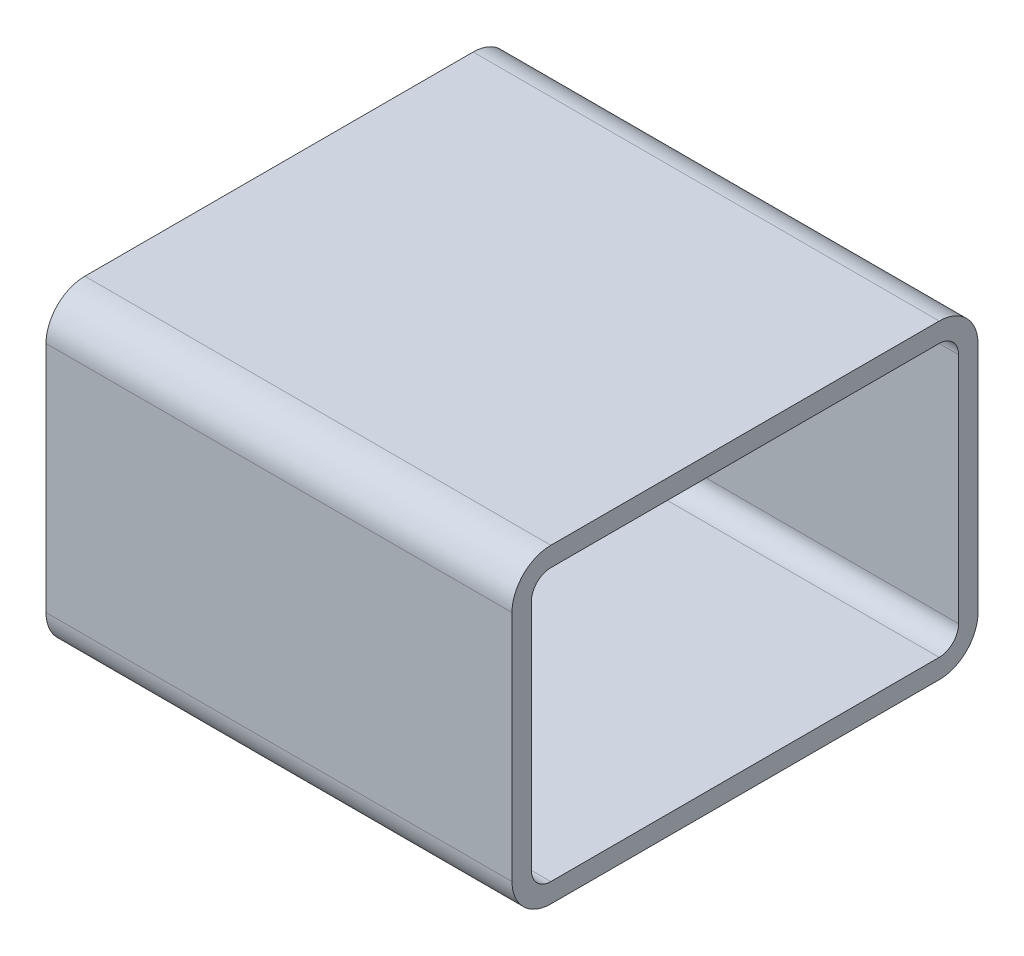
ISO-10303-21;
HEADER;
FILE_DESCRIPTION(('STEP AP214'),'2;1');
FILE_NAME('part.step','',(''),(''),'','','');
FILE_SCHEMA(('AUTOMOTIVE_DESIGN { 1 0 10303 214 1 1 1 1 }'));
ENDSEC;
DATA;
#1=APPLICATION_CONTEXT('core data for automotive mechanical design processes');
#2=APPLICATION_PROTOCOL_DEFINITION('international standard','automotive_design',2000,#1);
#3=PRODUCT_CONTEXT('',#1,'mechanical');
#4=PRODUCT('Part','Part','',(#3));
#5=PRODUCT_RELATED_PRODUCT_CATEGORY('part','',(#4));
#6=PRODUCT_DEFINITION_FORMATION('','',#4);
#7=PRODUCT_DEFINITION_CONTEXT('part definition',#1,'design');
#8=PRODUCT_DEFINITION('design','',#6,#7);
#9=PRODUCT_DEFINITION_SHAPE('','',#8);
#10=(LENGTH_UNIT() NAMED_UNIT(*) SI_UNIT(.MILLI.,.METRE.));
#11=(NAMED_UNIT(*) PLANE_ANGLE_UNIT() SI_UNIT($,.RADIAN.));
#12=(NAMED_UNIT(*) SI_UNIT($,.STERADIAN.) SOLID_ANGLE_UNIT());
#13=UNCERTAINTY_MEASURE_WITH_UNIT(LENGTH_MEASURE(1.E-05),#10,'distance_accuracy_value','');
#14=(GEOMETRIC_REPRESENTATION_CONTEXT(3) GLOBAL_UNCERTAINTY_ASSIGNED_CONTEXT((#13)) GLOBAL_UNIT_ASSIGNED_CONTEXT((#10,
#11,#12)) REPRESENTATION_CONTEXT('',''));
#15=CARTESIAN_POINT('',(0.,0.,0.));
#16=DIRECTION('',(0.,0.,1.));
#17=DIRECTION('',(1.,0.,0.));
#18=AXIS2_PLACEMENT_3D('',#15,#16,#17);
#19=CARTESIAN_POINT('',(0.,6.35,-38.1));
#20=DIRECTION('',(0.,0.,-1.));
#21=DIRECTION('',(-1.,0.,0.));
#22=AXIS2_PLACEMENT_3D('',#19,#20,#21);
#23=PLANE('',#22);
#24=DIRECTION('',(1.,0.,0.));
#25=VECTOR('',#24,1.);
#26=CARTESIAN_POINT('',(0.,6.35,-38.1));
#27=LINE('',#26,#25);
#28=CARTESIAN_POINT('',(0.,6.35,-38.1));
#29=VERTEX_POINT('',#28);
#30=CARTESIAN_POINT('',(76.2,6.35,-38.1));
#31=VERTEX_POINT('',#30);
#32=EDGE_CURVE('E111',#29,#31,#27,.T.);
#33=ORIENTED_EDGE('',*,*,#32,.F.);
#34=DIRECTION('',(0.,1.,0.));
#35=VECTOR('',#34,1.);
#36=CARTESIAN_POINT('',(0.,0.,-38.1));
#37=LINE('',#36,#35);
#38=CARTESIAN_POINT('',(0.,44.45,-38.1));
#39=VERTEX_POINT('',#38);
#40=EDGE_CURVE('E213',#29,#39,#37,.T.);
#41=ORIENTED_EDGE('',*,*,#40,.T.);
#42=DIRECTION('',(1.,0.,0.));
#43=VECTOR('',#42,1.);
#44=CARTESIAN_POINT('',(0.,44.45,-38.1));
#45=LINE('',#44,#43);
#46=CARTESIAN_POINT('',(76.2,44.45,-38.1));
#47=VERTEX_POINT('',#46);
#48=EDGE_CURVE('E188',#47,#39,#45,.F.);
#49=ORIENTED_EDGE('',*,*,#48,.F.);
#50=DIRECTION('',(0.,1.,0.));
#51=VECTOR('',#50,1.);
#52=CARTESIAN_POINT('',(76.2,0.,-38.1));
#53=LINE('',#52,#51);
#54=EDGE_CURVE('E115',#31,#47,#53,.T.);
#55=ORIENTED_EDGE('',*,*,#54,.F.);
#56=EDGE_LOOP('',(#33,#41,#49,#55));
#57=FACE_BOUND('',#56,.T.);
#58=ADVANCED_FACE('F17',(#57),#23,.T.);
#59=CARTESIAN_POINT('',(0.,44.45,-31.75));
#60=DIRECTION('',(1.,0.,0.));
#61=DIRECTION('',(0.,0.,-1.));
#62=AXIS2_PLACEMENT_3D('',#59,#60,#61);
#63=CYLINDRICAL_SURFACE('',#62,6.35);
#64=ORIENTED_EDGE('',*,*,#48,.T.);
#65=CARTESIAN_POINT('',(0.,44.45,-31.75));
#66=DIRECTION('',(1.,0.,0.));
#67=DIRECTION('',(0.,0.,-1.));
#68=AXIS2_PLACEMENT_3D('',#65,#66,#67);
#69=CIRCLE('',#68,6.35);
#70=CARTESIAN_POINT('',(0.,50.8,-31.75));
#71=VERTEX_POINT('',#70);
#72=EDGE_CURVE('E211',#39,#71,#69,.T.);
#73=ORIENTED_EDGE('',*,*,#72,.T.);
#74=DIRECTION('',(1.,0.,0.));
#75=VECTOR('',#74,1.);
#76=CARTESIAN_POINT('',(0.,50.8,-31.75));
#77=LINE('',#76,#75);
#78=CARTESIAN_POINT('',(76.2,50.8,-31.75));
#79=VERTEX_POINT('',#78);
#80=EDGE_CURVE('E185',#79,#71,#77,.F.);
#81=ORIENTED_EDGE('',*,*,#80,.F.);
#82=CARTESIAN_POINT('',(76.2,44.45,-31.75));
#83=DIRECTION('',(1.,0.,0.));
#84=DIRECTION('',(0.,0.,-1.));
#85=AXIS2_PLACEMENT_3D('',#82,#83,#84);
#86=CIRCLE('',#85,6.35);
#87=EDGE_CURVE('E154',#47,#79,#86,.T.);
#88=ORIENTED_EDGE('',*,*,#87,.F.);
#89=EDGE_LOOP('',(#64,#73,#81,#88));
#90=FACE_BOUND('',#89,.T.);
#91=ADVANCED_FACE('F229',(#90),#63,.T.);
#92=CARTESIAN_POINT('',(0.,50.8,-31.75));
#93=DIRECTION('',(0.,1.,0.));
#94=DIRECTION('',(0.,0.,1.));
#95=AXIS2_PLACEMENT_3D('',#92,#93,#94);
#96=PLANE('',#95);
#97=ORIENTED_EDGE('',*,*,#80,.T.);
#98=DIRECTION('',(0.,0.,-1.));
#99=VECTOR('',#98,1.);
#100=CARTESIAN_POINT('',(0.,50.8,0.));
#101=LINE('',#100,#99);
#102=CARTESIAN_POINT('',(0.,50.8,31.75));
#103=VERTEX_POINT('',#102);
#104=EDGE_CURVE('E210',#71,#103,#101,.F.);
#105=ORIENTED_EDGE('',*,*,#104,.T.);
#106=DIRECTION('',(1.,0.,0.));
#107=VECTOR('',#106,1.);
#108=CARTESIAN_POINT('',(0.,50.8,31.75));
#109=LINE('',#108,#107);
#110=CARTESIAN_POINT('',(76.2,50.8,31.75));
#111=VERTEX_POINT('',#110);
#112=EDGE_CURVE('E182',#111,#103,#109,.F.);
#113=ORIENTED_EDGE('',*,*,#112,.F.);
#114=DIRECTION('',(0.,0.,-1.));
#115=VECTOR('',#114,1.);
#116=CARTESIAN_POINT('',(76.2,50.8,0.));
#117=LINE('',#116,#115);
#118=EDGE_CURVE('E151',#79,#111,#117,.F.);
#119=ORIENTED_EDGE('',*,*,#118,.F.);
#120=EDGE_LOOP('',(#97,#105,#113,#119));
#121=FACE_BOUND('',#120,.T.);
#122=ADVANCED_FACE('F233',(#121),#96,.T.);
#123=CARTESIAN_POINT('',(0.,44.45,31.75));
#124=DIRECTION('',(1.,0.,0.));
#125=DIRECTION('',(0.,0.,-1.));
#126=AXIS2_PLACEMENT_3D('',#123,#124,#125);
#127=CYLINDRICAL_SURFACE('',#126,6.35);
#128=ORIENTED_EDGE('',*,*,#112,.T.);
#129=CARTESIAN_POINT('',(0.,44.45,31.75));
#130=DIRECTION('',(1.,0.,0.));
#131=DIRECTION('',(0.,0.,-1.));
#132=AXIS2_PLACEMENT_3D('',#129,#130,#131);
#133=CIRCLE('',#132,6.35);
#134=CARTESIAN_POINT('',(0.,44.45,38.1));
#135=VERTEX_POINT('',#134);
#136=EDGE_CURVE('E208',#103,#135,#133,.T.);
#137=ORIENTED_EDGE('',*,*,#136,.T.);
#138=DIRECTION('',(1.,0.,0.));
#139=VECTOR('',#138,1.);
#140=CARTESIAN_POINT('',(0.,44.45,38.1));
#141=LINE('',#140,#139);
#142=CARTESIAN_POINT('',(76.2,44.45,38.1));
#143=VERTEX_POINT('',#142);
#144=EDGE_CURVE('E176',#143,#135,#141,.F.);
#145=ORIENTED_EDGE('',*,*,#144,.F.);
#146=CARTESIAN_POINT('',(76.2,44.45,31.75));
#147=DIRECTION('',(1.,0.,0.));
#148=DIRECTION('',(0.,0.,-1.));
#149=AXIS2_PLACEMENT_3D('',#146,#147,#148);
#150=CIRCLE('',#149,6.35);
#151=EDGE_CURVE('E150',#111,#143,#150,.T.);
#152=ORIENTED_EDGE('',*,*,#151,.F.);
#153=EDGE_LOOP('',(#128,#137,#145,#152));
#154=FACE_BOUND('',#153,.T.);
#155=ADVANCED_FACE('F237',(#154),#127,.T.);
#156=CARTESIAN_POINT('',(0.,44.45,38.1));
#157=DIRECTION('',(0.,0.,1.));
#158=DIRECTION('',(1.,0.,0.));
#159=AXIS2_PLACEMENT_3D('',#156,#157,#158);
#160=PLANE('',#159);
#161=ORIENTED_EDGE('',*,*,#144,.T.);
#162=DIRECTION('',(0.,1.,0.));
#163=VECTOR('',#162,1.);
#164=CARTESIAN_POINT('',(0.,0.,38.1));
#165=LINE('',#164,#163);
#166=CARTESIAN_POINT('',(0.,6.35,38.1));
#167=VERTEX_POINT('',#166);
#168=EDGE_CURVE('E207',#135,#167,#165,.F.);
#169=ORIENTED_EDGE('',*,*,#168,.T.);
#170=DIRECTION('',(1.,0.,0.));
#171=VECTOR('',#170,1.);
#172=CARTESIAN_POINT('',(0.,6.35,38.1));
#173=LINE('',#172,#171);
#174=CARTESIAN_POINT('',(76.2,6.35,38.1));
#175=VERTEX_POINT('',#174);
#176=EDGE_CURVE('E177',#175,#167,#173,.F.);
#177=ORIENTED_EDGE('',*,*,#176,.F.);
#178=DIRECTION('',(0.,1.,0.));
#179=VECTOR('',#178,1.);
#180=CARTESIAN_POINT('',(76.2,0.,38.1));
#181=LINE('',#180,#179);
#182=EDGE_CURVE('E148',#143,#175,#181,.F.);
#183=ORIENTED_EDGE('',*,*,#182,.F.);
#184=EDGE_LOOP('',(#161,#169,#177,#183));
#185=FACE_BOUND('',#184,.T.);
#186=ADVANCED_FACE('F242',(#185),#160,.T.);
#187=CARTESIAN_POINT('',(0.,44.45,-31.75));
#188=DIRECTION('',(1.,0.,0.));
#189=DIRECTION('',(0.,0.,-1.));
#190=AXIS2_PLACEMENT_3D('',#187,#188,#189);
#191=CYLINDRICAL_SURFACE('',#190,3.175);
#192=CARTESIAN_POINT('',(76.2,44.45,-31.75));
#193=DIRECTION('',(1.,0.,0.));
#194=DIRECTION('',(0.,0.,-1.));
#195=AXIS2_PLACEMENT_3D('',#192,#193,#194);
#196=CIRCLE('',#195,3.175);
#197=CARTESIAN_POINT('',(76.2,47.625,-31.75));
#198=VERTEX_POINT('',#197);
#199=CARTESIAN_POINT('',(76.2,44.45,-34.925));
#200=VERTEX_POINT('',#199);
#201=EDGE_CURVE('E135',#198,#200,#196,.F.);
#202=ORIENTED_EDGE('',*,*,#201,.F.);
#203=DIRECTION('',(1.,0.,0.));
#204=VECTOR('',#203,1.);
#205=CARTESIAN_POINT('',(0.,47.625,-31.75));
#206=LINE('',#205,#204);
#207=CARTESIAN_POINT('',(0.,47.625,-31.75));
#208=VERTEX_POINT('',#207);
#209=EDGE_CURVE('E159',#208,#198,#206,.T.);
#210=ORIENTED_EDGE('',*,*,#209,.F.);
#211=CARTESIAN_POINT('',(0.,44.45,-31.75));
#212=DIRECTION('',(1.,0.,0.));
#213=DIRECTION('',(0.,0.,-1.));
#214=AXIS2_PLACEMENT_3D('',#211,#212,#213);
#215=CIRCLE('',#214,3.175);
#216=CARTESIAN_POINT('',(0.,44.45,-34.925));
#217=VERTEX_POINT('',#216);
#218=EDGE_CURVE('E203',#208,#217,#215,.F.);
#219=ORIENTED_EDGE('',*,*,#218,.T.);
#220=DIRECTION('',(1.,0.,0.));
#221=VECTOR('',#220,1.);
#222=CARTESIAN_POINT('',(0.,44.45,-34.925));
#223=LINE('',#222,#221);
#224=EDGE_CURVE('E173',#200,#217,#223,.F.);
#225=ORIENTED_EDGE('',*,*,#224,.F.);
#226=EDGE_LOOP('',(#202,#210,#219,#225));
#227=FACE_BOUND('',#226,.T.);
#228=ADVANCED_FACE('F307',(#227),#191,.F.);
#229=CARTESIAN_POINT('',(0.,44.45,-34.925));
#230=DIRECTION('',(0.,0.,1.));
#231=DIRECTION('',(1.,0.,0.));
#232=AXIS2_PLACEMENT_3D('',#229,#230,#231);
#233=PLANE('',#232);
#234=ORIENTED_EDGE('',*,*,#224,.T.);
#235=DIRECTION('',(0.,1.,0.));
#236=VECTOR('',#235,1.);
#237=CARTESIAN_POINT('',(0.,0.,-34.925));
#238=LINE('',#237,#236);
#239=CARTESIAN_POINT('',(0.,6.35,-34.925));
#240=VERTEX_POINT('',#239);
#241=EDGE_CURVE('E202',#217,#240,#238,.F.);
#242=ORIENTED_EDGE('',*,*,#241,.T.);
#243=DIRECTION('',(1.,0.,0.));
#244=VECTOR('',#243,1.);
#245=CARTESIAN_POINT('',(0.,6.35,-34.925));
#246=LINE('',#245,#244);
#247=CARTESIAN_POINT('',(76.2,6.35,-34.925));
#248=VERTEX_POINT('',#247);
#249=EDGE_CURVE('E171',#240,#248,#246,.T.);
#250=ORIENTED_EDGE('',*,*,#249,.T.);
#251=DIRECTION('',(0.,1.,0.));
#252=VECTOR('',#251,1.);
#253=CARTESIAN_POINT('',(76.2,0.,-34.925));
#254=LINE('',#253,#252);
#255=EDGE_CURVE('E145',#200,#248,#254,.F.);
#256=ORIENTED_EDGE('',*,*,#255,.F.);
#257=EDGE_LOOP('',(#234,#242,#250,#256));
#258=FACE_BOUND('',#257,.T.);
#259=ADVANCED_FACE('F306',(#258),#233,.T.);
#260=CARTESIAN_POINT('',(0.,6.35,-31.75));
#261=DIRECTION('',(1.,0.,0.));
#262=DIRECTION('',(0.,0.,-1.));
#263=AXIS2_PLACEMENT_3D('',#260,#261,#262);
#264=CYLINDRICAL_SURFACE('',#263,3.175);
#265=CARTESIAN_POINT('',(76.2,6.35,-31.75));
#266=DIRECTION('',(1.,0.,0.));
#267=DIRECTION('',(0.,0.,-1.));
#268=AXIS2_PLACEMENT_3D('',#265,#266,#267);
#269=CIRCLE('',#268,3.175);
#270=CARTESIAN_POINT('',(76.2,3.175,-31.75));
#271=VERTEX_POINT('',#270);
#272=EDGE_CURVE('E144',#248,#271,#269,.F.);
#273=ORIENTED_EDGE('',*,*,#272,.F.);
#274=ORIENTED_EDGE('',*,*,#249,.F.);
#275=CARTESIAN_POINT('',(0.,6.35,-31.75));
#276=DIRECTION('',(1.,0.,0.));
#277=DIRECTION('',(0.,0.,-1.));
#278=AXIS2_PLACEMENT_3D('',#275,#276,#277);
#279=CIRCLE('',#278,3.175);
#280=CARTESIAN_POINT('',(0.,3.175,-31.75));
#281=VERTEX_POINT('',#280);
#282=EDGE_CURVE('E199',#240,#281,#279,.F.);
#283=ORIENTED_EDGE('',*,*,#282,.T.);
#284=DIRECTION('',(1.,0.,0.));
#285=VECTOR('',#284,1.);
#286=CARTESIAN_POINT('',(0.,3.175,-31.75));
#287=LINE('',#286,#285);
#288=EDGE_CURVE('E168',#271,#281,#287,.F.);
#289=ORIENTED_EDGE('',*,*,#288,.F.);
#290=EDGE_LOOP('',(#273,#274,#283,#289));
#291=FACE_BOUND('',#290,.T.);
#292=ADVANCED_FACE('F304',(#291),#264,.F.);
#293=CARTESIAN_POINT('',(0.,3.175,-31.75));
#294=DIRECTION('',(0.,1.,0.));
#295=DIRECTION('',(0.,0.,1.));
#296=AXIS2_PLACEMENT_3D('',#293,#294,#295);
#297=PLANE('',#296);
#298=ORIENTED_EDGE('',*,*,#288,.T.);
#299=DIRECTION('',(0.,0.,-1.));
#300=VECTOR('',#299,1.);
#301=CARTESIAN_POINT('',(0.,3.175,0.));
#302=LINE('',#301,#300);
#303=CARTESIAN_POINT('',(0.,3.175,31.75));
#304=VERTEX_POINT('',#303);
#305=EDGE_CURVE('E198',#281,#304,#302,.F.);
#306=ORIENTED_EDGE('',*,*,#305,.T.);
#307=DIRECTION('',(1.,0.,0.));
#308=VECTOR('',#307,1.);
#309=CARTESIAN_POINT('',(0.,3.175,31.75));
#310=LINE('',#309,#308);
#311=CARTESIAN_POINT('',(76.2,3.175,31.75));
#312=VERTEX_POINT('',#311);
#313=EDGE_CURVE('E166',#304,#312,#310,.T.);
#314=ORIENTED_EDGE('',*,*,#313,.T.);
#315=DIRECTION('',(0.,0.,-1.));
#316=VECTOR('',#315,1.);
#317=CARTESIAN_POINT('',(76.2,3.175,0.));
#318=LINE('',#317,#316);
#319=EDGE_CURVE('E141',#271,#312,#318,.F.);
#320=ORIENTED_EDGE('',*,*,#319,.F.);
#321=EDGE_LOOP('',(#298,#306,#314,#320));
#322=FACE_BOUND('',#321,.T.);
#323=ADVANCED_FACE('F293',(#322),#297,.T.);
#324=CARTESIAN_POINT('',(0.,6.35,31.75));
#325=DIRECTION('',(1.,0.,0.));
#326=DIRECTION('',(0.,0.,-1.));
#327=AXIS2_PLACEMENT_3D('',#324,#325,#326);
#328=CYLINDRICAL_SURFACE('',#327,3.175);
#329=CARTESIAN_POINT('',(76.2,6.35,31.75));
#330=DIRECTION('',(1.,0.,0.));
#331=DIRECTION('',(0.,0.,-1.));
#332=AXIS2_PLACEMENT_3D('',#329,#330,#331);
#333=CIRCLE('',#332,3.175);
#334=CARTESIAN_POINT('',(76.2,6.35,34.925));
#335=VERTEX_POINT('',#334);
#336=EDGE_CURVE('E140',#312,#335,#333,.F.);
#337=ORIENTED_EDGE('',*,*,#336,.F.);
#338=ORIENTED_EDGE('',*,*,#313,.F.);
#339=CARTESIAN_POINT('',(0.,6.35,31.75));
#340=DIRECTION('',(1.,0.,0.));
#341=DIRECTION('',(0.,0.,-1.));
#342=AXIS2_PLACEMENT_3D('',#339,#340,#341);
#343=CIRCLE('',#342,3.175);
#344=CARTESIAN_POINT('',(0.,6.35,34.925));
#345=VERTEX_POINT('',#344);
#346=EDGE_CURVE('E195',#304,#345,#343,.F.);
#347=ORIENTED_EDGE('',*,*,#346,.T.);
#348=DIRECTION('',(-1.,0.,0.));
#349=VECTOR('',#348,1.);
#350=CARTESIAN_POINT('',(0.,6.35,34.925));
#351=LINE('',#350,#349);
#352=EDGE_CURVE('E163',#335,#345,#351,.T.);
#353=ORIENTED_EDGE('',*,*,#352,.F.);
#354=EDGE_LOOP('',(#337,#338,#347,#353));
#355=FACE_BOUND('',#354,.T.);
#356=ADVANCED_FACE('F298',(#355),#328,.F.);
#357=CARTESIAN_POINT('',(0.,6.35,34.925));
#358=DIRECTION('',(0.,0.,-1.));
#359=DIRECTION('',(-1.,0.,0.));
#360=AXIS2_PLACEMENT_3D('',#357,#358,#359);
#361=PLANE('',#360);
#362=ORIENTED_EDGE('',*,*,#352,.T.);
#363=DIRECTION('',(0.,1.,0.));
#364=VECTOR('',#363,1.);
#365=CARTESIAN_POINT('',(0.,0.,34.925));
#366=LINE('',#365,#364);
#367=CARTESIAN_POINT('',(0.,44.45,34.925));
#368=VERTEX_POINT('',#367);
#369=EDGE_CURVE('E194',#345,#368,#366,.T.);
#370=ORIENTED_EDGE('',*,*,#369,.T.);
#371=DIRECTION('',(1.,0.,0.));
#372=VECTOR('',#371,1.);
#373=CARTESIAN_POINT('',(0.,44.45,34.925));
#374=LINE('',#373,#372);
#375=CARTESIAN_POINT('',(76.2,44.45,34.925));
#376=VERTEX_POINT('',#375);
#377=EDGE_CURVE('E161',#368,#376,#374,.T.);
#378=ORIENTED_EDGE('',*,*,#377,.T.);
#379=DIRECTION('',(0.,1.,0.));
#380=VECTOR('',#379,1.);
#381=CARTESIAN_POINT('',(76.2,0.,34.925));
#382=LINE('',#381,#380);
#383=EDGE_CURVE('E137',#335,#376,#382,.T.);
#384=ORIENTED_EDGE('',*,*,#383,.F.);
#385=EDGE_LOOP('',(#362,#370,#378,#384));
#386=FACE_BOUND('',#385,.T.);
#387=ADVANCED_FACE('F258',(#386),#361,.T.);
#388=CARTESIAN_POINT('',(0.,44.45,31.75));
#389=DIRECTION('',(1.,0.,0.));
#390=DIRECTION('',(0.,0.,-1.));
#391=AXIS2_PLACEMENT_3D('',#388,#389,#390);
#392=CYLINDRICAL_SURFACE('',#391,3.175);
#393=CARTESIAN_POINT('',(76.2,44.45,31.75));
#394=DIRECTION('',(1.,0.,0.));
#395=DIRECTION('',(0.,0.,-1.));
#396=AXIS2_PLACEMENT_3D('',#393,#394,#395);
#397=CIRCLE('',#396,3.175);
#398=CARTESIAN_POINT('',(76.2,47.625,31.75));
#399=VERTEX_POINT('',#398);
#400=EDGE_CURVE('E136',#376,#399,#397,.F.);
#401=ORIENTED_EDGE('',*,*,#400,.F.);
#402=ORIENTED_EDGE('',*,*,#377,.F.);
#403=CARTESIAN_POINT('',(0.,44.45,31.75));
#404=DIRECTION('',(1.,0.,0.));
#405=DIRECTION('',(0.,0.,-1.));
#406=AXIS2_PLACEMENT_3D('',#403,#404,#405);
#407=CIRCLE('',#406,3.175);
#408=CARTESIAN_POINT('',(0.,47.625,31.75));
#409=VERTEX_POINT('',#408);
#410=EDGE_CURVE('E128',#368,#409,#407,.F.);
#411=ORIENTED_EDGE('',*,*,#410,.T.);
#412=DIRECTION('',(1.,0.,0.));
#413=VECTOR('',#412,1.);
#414=CARTESIAN_POINT('',(0.,47.625,31.75));
#415=LINE('',#414,#413);
#416=EDGE_CURVE('E156',#399,#409,#415,.F.);
#417=ORIENTED_EDGE('',*,*,#416,.F.);
#418=EDGE_LOOP('',(#401,#402,#411,#417));
#419=FACE_BOUND('',#418,.T.);
#420=ADVANCED_FACE('F267',(#419),#392,.F.);
#421=CARTESIAN_POINT('',(0.,47.625,31.75));
#422=DIRECTION('',(0.,-1.,0.));
#423=DIRECTION('',(0.,0.,-1.));
#424=AXIS2_PLACEMENT_3D('',#421,#422,#423);
#425=PLANE('',#424);
#426=ORIENTED_EDGE('',*,*,#416,.T.);
#427=DIRECTION('',(0.,0.,-1.));
#428=VECTOR('',#427,1.);
#429=CARTESIAN_POINT('',(0.,47.625,0.));
#430=LINE('',#429,#428);
#431=EDGE_CURVE('E125',#409,#208,#430,.T.);
#432=ORIENTED_EDGE('',*,*,#431,.T.);
#433=ORIENTED_EDGE('',*,*,#209,.T.);
#434=DIRECTION('',(0.,0.,-1.));
#435=VECTOR('',#434,1.);
#436=CARTESIAN_POINT('',(76.2,47.625,0.));
#437=LINE('',#436,#435);
#438=EDGE_CURVE('E132',#399,#198,#437,.T.);
#439=ORIENTED_EDGE('',*,*,#438,.F.);
#440=EDGE_LOOP('',(#426,#432,#433,#439));
#441=FACE_BOUND('',#440,.T.);
#442=ADVANCED_FACE('F276',(#441),#425,.T.);
#443=CARTESIAN_POINT('',(0.,6.35,-31.75));
#444=DIRECTION('',(1.,0.,0.));
#445=DIRECTION('',(0.,0.,-1.));
#446=AXIS2_PLACEMENT_3D('',#443,#444,#445);
#447=CYLINDRICAL_SURFACE('',#446,6.35);
#448=DIRECTION('',(1.,0.,0.));
#449=VECTOR('',#448,1.);
#450=CARTESIAN_POINT('',(0.,0.,-31.75));
#451=LINE('',#450,#449);
#452=CARTESIAN_POINT('',(0.,0.,-31.75));
#453=VERTEX_POINT('',#452);
#454=CARTESIAN_POINT('',(76.2,0.,-31.75));
#455=VERTEX_POINT('',#454);
#456=EDGE_CURVE('E109',#453,#455,#451,.T.);
#457=ORIENTED_EDGE('',*,*,#456,.F.);
#458=CARTESIAN_POINT('',(0.,6.35,-31.75));
#459=DIRECTION('',(1.,0.,0.));
#460=DIRECTION('',(0.,0.,-1.));
#461=AXIS2_PLACEMENT_3D('',#458,#459,#460);
#462=CIRCLE('',#461,6.35);
#463=EDGE_CURVE('E179',#453,#29,#462,.T.);
#464=ORIENTED_EDGE('',*,*,#463,.T.);
#465=ORIENTED_EDGE('',*,*,#32,.T.);
#466=CARTESIAN_POINT('',(76.2,6.35,-31.75));
#467=DIRECTION('',(1.,0.,0.));
#468=DIRECTION('',(0.,0.,-1.));
#469=AXIS2_PLACEMENT_3D('',#466,#467,#468);
#470=CIRCLE('',#469,6.35);
#471=EDGE_CURVE('E20',#455,#31,#470,.T.);
#472=ORIENTED_EDGE('',*,*,#471,.F.);
#473=EDGE_LOOP('',(#457,#464,#465,#472));
#474=FACE_BOUND('',#473,.T.);
#475=ADVANCED_FACE('F106',(#474),#447,.T.);
#476=CARTESIAN_POINT('',(76.2,0.,0.));
#477=DIRECTION('',(1.,0.,0.));
#478=DIRECTION('',(0.,0.,-1.));
#479=AXIS2_PLACEMENT_3D('',#476,#477,#478);
#480=PLANE('',#479);
#481=ORIENTED_EDGE('',*,*,#438,.T.);
#482=ORIENTED_EDGE('',*,*,#201,.T.);
#483=ORIENTED_EDGE('',*,*,#255,.T.);
#484=ORIENTED_EDGE('',*,*,#272,.T.);
#485=ORIENTED_EDGE('',*,*,#319,.T.);
#486=ORIENTED_EDGE('',*,*,#336,.T.);
#487=ORIENTED_EDGE('',*,*,#383,.T.);
#488=ORIENTED_EDGE('',*,*,#400,.T.);
#489=EDGE_LOOP('',(#481,#482,#483,#484,#485,#486,#487,#488));
#490=FACE_BOUND('',#489,.T.);
#491=CARTESIAN_POINT('',(76.2,6.35,31.75));
#492=DIRECTION('',(1.,0.,0.));
#493=DIRECTION('',(0.,0.,-1.));
#494=AXIS2_PLACEMENT_3D('',#491,#492,#493);
#495=CIRCLE('',#494,6.35);
#496=CARTESIAN_POINT('',(76.2,0.,31.75));
#497=VERTEX_POINT('',#496);
#498=EDGE_CURVE('E120',#497,#175,#495,.F.);
#499=ORIENTED_EDGE('',*,*,#498,.F.);
#500=DIRECTION('',(0.,0.,-1.));
#501=VECTOR('',#500,1.);
#502=CARTESIAN_POINT('',(76.2,0.,31.75));
#503=LINE('',#502,#501);
#504=EDGE_CURVE('E117',#455,#497,#503,.F.);
#505=ORIENTED_EDGE('',*,*,#504,.F.);
#506=ORIENTED_EDGE('',*,*,#471,.T.);
#507=ORIENTED_EDGE('',*,*,#54,.T.);
#508=ORIENTED_EDGE('',*,*,#87,.T.);
#509=ORIENTED_EDGE('',*,*,#118,.T.);
#510=ORIENTED_EDGE('',*,*,#151,.T.);
#511=ORIENTED_EDGE('',*,*,#182,.T.);
#512=EDGE_LOOP('',(#499,#505,#506,#507,#508,#509,#510,#511));
#513=FACE_BOUND('',#512,.T.);
#514=ADVANCED_FACE('F118',(#490,#513),#480,.T.);
#515=CARTESIAN_POINT('',(0.,6.35,31.75));
#516=DIRECTION('',(1.,0.,0.));
#517=DIRECTION('',(0.,0.,-1.));
#518=AXIS2_PLACEMENT_3D('',#515,#516,#517);
#519=CYLINDRICAL_SURFACE('',#518,6.35);
#520=ORIENTED_EDGE('',*,*,#176,.T.);
#521=CARTESIAN_POINT('',(0.,6.35,31.75));
#522=DIRECTION('',(1.,0.,0.));
#523=DIRECTION('',(0.,0.,-1.));
#524=AXIS2_PLACEMENT_3D('',#521,#522,#523);
#525=CIRCLE('',#524,6.35);
#526=CARTESIAN_POINT('',(0.,0.,31.75));
#527=VERTEX_POINT('',#526);
#528=EDGE_CURVE('E35',#167,#527,#525,.T.);
#529=ORIENTED_EDGE('',*,*,#528,.T.);
#530=DIRECTION('',(1.,0.,0.));
#531=VECTOR('',#530,1.);
#532=CARTESIAN_POINT('',(0.,0.,31.75));
#533=LINE('',#532,#531);
#534=EDGE_CURVE('E26',#497,#527,#533,.F.);
#535=ORIENTED_EDGE('',*,*,#534,.F.);
#536=ORIENTED_EDGE('',*,*,#498,.T.);
#537=EDGE_LOOP('',(#520,#529,#535,#536));
#538=FACE_BOUND('',#537,.T.);
#539=ADVANCED_FACE('F244',(#538),#519,.T.);
#540=CARTESIAN_POINT('',(0.,0.,0.));
#541=DIRECTION('',(1.,0.,0.));
#542=DIRECTION('',(0.,0.,-1.));
#543=AXIS2_PLACEMENT_3D('',#540,#541,#542);
#544=PLANE('',#543);
#545=ORIENTED_EDGE('',*,*,#410,.F.);
#546=ORIENTED_EDGE('',*,*,#369,.F.);
#547=ORIENTED_EDGE('',*,*,#346,.F.);
#548=ORIENTED_EDGE('',*,*,#305,.F.);
#549=ORIENTED_EDGE('',*,*,#282,.F.);
#550=ORIENTED_EDGE('',*,*,#241,.F.);
#551=ORIENTED_EDGE('',*,*,#218,.F.);
#552=ORIENTED_EDGE('',*,*,#431,.F.);
#553=EDGE_LOOP('',(#545,#546,#547,#548,#549,#550,#551,#552));
#554=FACE_BOUND('',#553,.T.);
#555=ORIENTED_EDGE('',*,*,#168,.F.);
#556=ORIENTED_EDGE('',*,*,#136,.F.);
#557=ORIENTED_EDGE('',*,*,#104,.F.);
#558=ORIENTED_EDGE('',*,*,#72,.F.);
#559=ORIENTED_EDGE('',*,*,#40,.F.);
#560=ORIENTED_EDGE('',*,*,#463,.F.);
#561=DIRECTION('',(0.,0.,-1.));
#562=VECTOR('',#561,1.);
#563=CARTESIAN_POINT('',(0.,0.,31.75));
#564=LINE('',#563,#562);
#565=EDGE_CURVE('E11',#527,#453,#564,.T.);
#566=ORIENTED_EDGE('',*,*,#565,.F.);
#567=ORIENTED_EDGE('',*,*,#528,.F.);
#568=EDGE_LOOP('',(#555,#556,#557,#558,#559,#560,#566,#567));
#569=FACE_BOUND('',#568,.T.);
#570=ADVANCED_FACE('F269',(#554,#569),#544,.F.);
#571=CARTESIAN_POINT('',(0.,0.,31.75));
#572=DIRECTION('',(0.,-1.,0.));
#573=DIRECTION('',(0.,0.,-1.));
#574=AXIS2_PLACEMENT_3D('',#571,#572,#573);
#575=PLANE('',#574);
#576=ORIENTED_EDGE('',*,*,#534,.T.);
#577=ORIENTED_EDGE('',*,*,#565,.T.);
#578=ORIENTED_EDGE('',*,*,#456,.T.);
#579=ORIENTED_EDGE('',*,*,#504,.T.);
#580=EDGE_LOOP('',(#576,#577,#578,#579));
#581=FACE_BOUND('',#580,.T.);
#582=ADVANCED_FACE('F124',(#581),#575,.T.);
#583=CLOSED_SHELL('',(#58,#91,#122,#155,#186,#228,#259,#292,#323,#356,#387,#420,#442,#475,#514,
#539,#570,#582));
#584=MANIFOLD_SOLID_BREP('B1',#583);
#585=ADVANCED_BREP_SHAPE_REPRESENTATION('',(#18,#584),#14);
#586=SHAPE_DEFINITION_REPRESENTATION(#9,#585);
ENDSEC;
END-ISO-10303-21;
